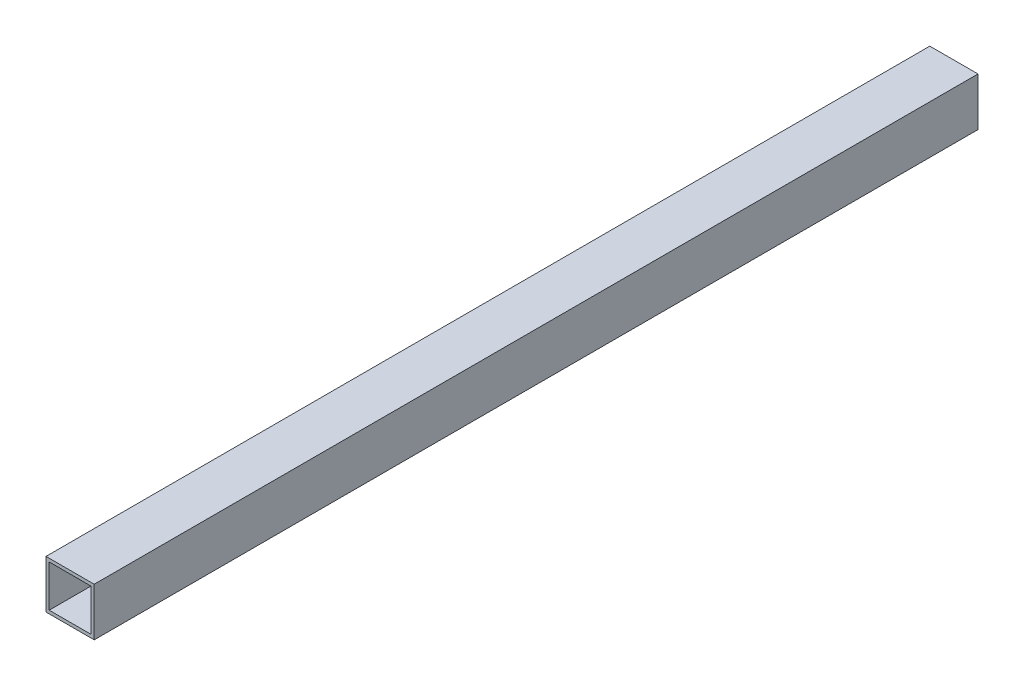
ISO-10303-21;
HEADER;
FILE_DESCRIPTION(('STEP AP214'),'2;1');
FILE_NAME('part.step','',(''),(''),'','','');
FILE_SCHEMA(('AUTOMOTIVE_DESIGN { 1 0 10303 214 1 1 1 1 }'));
ENDSEC;
DATA;
#1=APPLICATION_CONTEXT('core data for automotive mechanical design processes');
#2=APPLICATION_PROTOCOL_DEFINITION('international standard','automotive_design',2000,#1);
#3=PRODUCT_CONTEXT('',#1,'mechanical');
#4=PRODUCT('Part','Part','',(#3));
#5=PRODUCT_RELATED_PRODUCT_CATEGORY('part','',(#4));
#6=PRODUCT_DEFINITION_FORMATION('','',#4);
#7=PRODUCT_DEFINITION_CONTEXT('part definition',#1,'design');
#8=PRODUCT_DEFINITION('design','',#6,#7);
#9=PRODUCT_DEFINITION_SHAPE('','',#8);
#10=(LENGTH_UNIT() NAMED_UNIT(*) SI_UNIT(.MILLI.,.METRE.));
#11=(NAMED_UNIT(*) PLANE_ANGLE_UNIT() SI_UNIT($,.RADIAN.));
#12=(NAMED_UNIT(*) SI_UNIT($,.STERADIAN.) SOLID_ANGLE_UNIT());
#13=UNCERTAINTY_MEASURE_WITH_UNIT(LENGTH_MEASURE(1.E-05),#10,'distance_accuracy_value','');
#14=(GEOMETRIC_REPRESENTATION_CONTEXT(3) GLOBAL_UNCERTAINTY_ASSIGNED_CONTEXT((#13)) GLOBAL_UNIT_ASSIGNED_CONTEXT((#10,
#11,#12)) REPRESENTATION_CONTEXT('',''));
#15=CARTESIAN_POINT('',(0.,0.,0.));
#16=DIRECTION('',(0.,0.,1.));
#17=DIRECTION('',(1.,0.,0.));
#18=AXIS2_PLACEMENT_3D('',#15,#16,#17);
#19=CARTESIAN_POINT('',(-94.2052139280012,59.6622468790826,550.));
#20=DIRECTION('',(1.,0.,0.));
#21=DIRECTION('',(0.,0.,-1.));
#22=AXIS2_PLACEMENT_3D('',#19,#20,#21);
#23=PLANE('',#22);
#24=DIRECTION('',(0.,-1.,0.));
#25=VECTOR('',#24,1.);
#26=CARTESIAN_POINT('',(-94.2052139280012,59.6622468790826,0.));
#27=LINE('',#26,#25);
#28=CARTESIAN_POINT('',(-94.2052139280012,59.6622468790826,0.));
#29=VERTEX_POINT('',#28);
#30=CARTESIAN_POINT('',(-94.2052139280012,29.6622468790826,0.));
#31=VERTEX_POINT('',#30);
#32=EDGE_CURVE('E144',#29,#31,#27,.T.);
#33=ORIENTED_EDGE('',*,*,#32,.T.);
#34=DIRECTION('',(0.,0.,-1.));
#35=VECTOR('',#34,1.);
#36=CARTESIAN_POINT('',(-94.2052139280012,29.6622468790826,550.));
#37=LINE('',#36,#35);
#38=CARTESIAN_POINT('',(-94.2052139280012,29.6622468790826,550.));
#39=VERTEX_POINT('',#38);
#40=EDGE_CURVE('E11',#39,#31,#37,.T.);
#41=ORIENTED_EDGE('',*,*,#40,.F.);
#42=DIRECTION('',(0.,-1.,0.));
#43=VECTOR('',#42,1.);
#44=CARTESIAN_POINT('',(-94.2052139280012,59.6622468790826,550.));
#45=LINE('',#44,#43);
#46=CARTESIAN_POINT('',(-94.2052139280012,59.6622468790826,550.));
#47=VERTEX_POINT('',#46);
#48=EDGE_CURVE('E133',#47,#39,#45,.T.);
#49=ORIENTED_EDGE('',*,*,#48,.F.);
#50=DIRECTION('',(0.,0.,-1.));
#51=VECTOR('',#50,1.);
#52=CARTESIAN_POINT('',(-94.2052139280012,59.6622468790826,550.));
#53=LINE('',#52,#51);
#54=EDGE_CURVE('E143',#47,#29,#53,.T.);
#55=ORIENTED_EDGE('',*,*,#54,.T.);
#56=EDGE_LOOP('',(#33,#41,#49,#55));
#57=FACE_BOUND('',#56,.T.);
#58=ADVANCED_FACE('F36',(#57),#23,.F.);
#59=CARTESIAN_POINT('',(-94.2052139280012,29.6622468790826,550.));
#60=DIRECTION('',(0.,1.,0.));
#61=DIRECTION('',(0.,0.,1.));
#62=AXIS2_PLACEMENT_3D('',#59,#60,#61);
#63=PLANE('',#62);
#64=DIRECTION('',(1.,0.,0.));
#65=VECTOR('',#64,1.);
#66=CARTESIAN_POINT('',(-94.2052139280012,29.6622468790826,0.));
#67=LINE('',#66,#65);
#68=CARTESIAN_POINT('',(-64.2052139280012,29.6622468790826,0.));
#69=VERTEX_POINT('',#68);
#70=EDGE_CURVE('E147',#31,#69,#67,.T.);
#71=ORIENTED_EDGE('',*,*,#70,.T.);
#72=DIRECTION('',(0.,0.,-1.));
#73=VECTOR('',#72,1.);
#74=CARTESIAN_POINT('',(-64.2052139280012,29.6622468790826,550.));
#75=LINE('',#74,#73);
#76=CARTESIAN_POINT('',(-64.2052139280012,29.6622468790826,550.));
#77=VERTEX_POINT('',#76);
#78=EDGE_CURVE('E43',#77,#69,#75,.T.);
#79=ORIENTED_EDGE('',*,*,#78,.F.);
#80=DIRECTION('',(1.,0.,0.));
#81=VECTOR('',#80,1.);
#82=CARTESIAN_POINT('',(-94.2052139280012,29.6622468790826,550.));
#83=LINE('',#82,#81);
#84=EDGE_CURVE('E136',#39,#77,#83,.T.);
#85=ORIENTED_EDGE('',*,*,#84,.F.);
#86=ORIENTED_EDGE('',*,*,#40,.T.);
#87=EDGE_LOOP('',(#71,#79,#85,#86));
#88=FACE_BOUND('',#87,.T.);
#89=ADVANCED_FACE('F175',(#88),#63,.F.);
#90=CARTESIAN_POINT('',(-64.2052139280012,59.6622468790826,550.));
#91=DIRECTION('',(-1.,0.,0.));
#92=DIRECTION('',(0.,0.,1.));
#93=AXIS2_PLACEMENT_3D('',#90,#91,#92);
#94=PLANE('',#93);
#95=DIRECTION('',(0.,1.,0.));
#96=VECTOR('',#95,1.);
#97=CARTESIAN_POINT('',(-64.2052139280012,59.6622468790826,0.));
#98=LINE('',#97,#96);
#99=CARTESIAN_POINT('',(-64.2052139280012,59.6622468790826,0.));
#100=VERTEX_POINT('',#99);
#101=EDGE_CURVE('E149',#69,#100,#98,.T.);
#102=ORIENTED_EDGE('',*,*,#101,.T.);
#103=DIRECTION('',(0.,0.,-1.));
#104=VECTOR('',#103,1.);
#105=CARTESIAN_POINT('',(-64.2052139280012,59.6622468790826,550.));
#106=LINE('',#105,#104);
#107=CARTESIAN_POINT('',(-64.2052139280012,59.6622468790826,550.));
#108=VERTEX_POINT('',#107);
#109=EDGE_CURVE('E154',#108,#100,#106,.T.);
#110=ORIENTED_EDGE('',*,*,#109,.F.);
#111=DIRECTION('',(0.,1.,0.));
#112=VECTOR('',#111,1.);
#113=CARTESIAN_POINT('',(-64.2052139280012,59.6622468790826,550.));
#114=LINE('',#113,#112);
#115=EDGE_CURVE('E139',#77,#108,#114,.T.);
#116=ORIENTED_EDGE('',*,*,#115,.F.);
#117=ORIENTED_EDGE('',*,*,#78,.T.);
#118=EDGE_LOOP('',(#102,#110,#116,#117));
#119=FACE_BOUND('',#118,.T.);
#120=ADVANCED_FACE('F161',(#119),#94,.F.);
#121=CARTESIAN_POINT('',(-94.2052139280012,59.6622468790826,550.));
#122=DIRECTION('',(0.,-1.,0.));
#123=DIRECTION('',(0.,0.,-1.));
#124=AXIS2_PLACEMENT_3D('',#121,#122,#123);
#125=PLANE('',#124);
#126=DIRECTION('',(-1.,0.,0.));
#127=VECTOR('',#126,1.);
#128=CARTESIAN_POINT('',(-94.2052139280012,59.6622468790826,0.));
#129=LINE('',#128,#127);
#130=EDGE_CURVE('E137',#100,#29,#129,.T.);
#131=ORIENTED_EDGE('',*,*,#130,.T.);
#132=ORIENTED_EDGE('',*,*,#54,.F.);
#133=DIRECTION('',(-1.,0.,0.));
#134=VECTOR('',#133,1.);
#135=CARTESIAN_POINT('',(-94.2052139280012,59.6622468790826,550.));
#136=LINE('',#135,#134);
#137=EDGE_CURVE('E141',#108,#47,#136,.T.);
#138=ORIENTED_EDGE('',*,*,#137,.F.);
#139=ORIENTED_EDGE('',*,*,#109,.T.);
#140=EDGE_LOOP('',(#131,#132,#138,#139));
#141=FACE_BOUND('',#140,.T.);
#142=ADVANCED_FACE('F168',(#141),#125,.F.);
#143=CARTESIAN_POINT('',(0.,0.,550.));
#144=DIRECTION('',(0.,0.,1.));
#145=DIRECTION('',(1.,0.,0.));
#146=AXIS2_PLACEMENT_3D('',#143,#144,#145);
#147=PLANE('',#146);
#148=DIRECTION('',(0.,-1.,0.));
#149=VECTOR('',#148,1.);
#150=CARTESIAN_POINT('',(-92.2052139280012,59.6622468790826,550.));
#151=LINE('',#150,#149);
#152=CARTESIAN_POINT('',(-92.2052139280012,57.6622468790826,550.));
#153=VERTEX_POINT('',#152);
#154=CARTESIAN_POINT('',(-92.2052139280012,31.6622468790826,550.));
#155=VERTEX_POINT('',#154);
#156=EDGE_CURVE('E121',#153,#155,#151,.T.);
#157=ORIENTED_EDGE('',*,*,#156,.F.);
#158=DIRECTION('',(-1.,0.,0.));
#159=VECTOR('',#158,1.);
#160=CARTESIAN_POINT('',(-94.2052139280012,57.6622468790826,550.));
#161=LINE('',#160,#159);
#162=CARTESIAN_POINT('',(-66.2052139280012,57.6622468790826,550.));
#163=VERTEX_POINT('',#162);
#164=EDGE_CURVE('E105',#163,#153,#161,.T.);
#165=ORIENTED_EDGE('',*,*,#164,.F.);
#166=DIRECTION('',(0.,1.,0.));
#167=VECTOR('',#166,1.);
#168=CARTESIAN_POINT('',(-66.2052139280012,59.6622468790826,550.));
#169=LINE('',#168,#167);
#170=CARTESIAN_POINT('',(-66.2052139280012,31.6622468790826,550.));
#171=VERTEX_POINT('',#170);
#172=EDGE_CURVE('E130',#171,#163,#169,.T.);
#173=ORIENTED_EDGE('',*,*,#172,.F.);
#174=DIRECTION('',(1.,0.,0.));
#175=VECTOR('',#174,1.);
#176=CARTESIAN_POINT('',(-94.2052139280012,31.6622468790826,550.));
#177=LINE('',#176,#175);
#178=EDGE_CURVE('E123',#155,#171,#177,.T.);
#179=ORIENTED_EDGE('',*,*,#178,.F.);
#180=EDGE_LOOP('',(#157,#165,#173,#179));
#181=FACE_BOUND('',#180,.T.);
#182=ORIENTED_EDGE('',*,*,#48,.T.);
#183=ORIENTED_EDGE('',*,*,#84,.T.);
#184=ORIENTED_EDGE('',*,*,#115,.T.);
#185=ORIENTED_EDGE('',*,*,#137,.T.);
#186=EDGE_LOOP('',(#182,#183,#184,#185));
#187=FACE_BOUND('',#186,.T.);
#188=ADVANCED_FACE('F174',(#181,#187),#147,.T.);
#189=CARTESIAN_POINT('',(0.,0.,0.));
#190=DIRECTION('',(0.,0.,1.));
#191=DIRECTION('',(1.,0.,0.));
#192=AXIS2_PLACEMENT_3D('',#189,#190,#191);
#193=PLANE('',#192);
#194=DIRECTION('',(-1.,0.,0.));
#195=VECTOR('',#194,1.);
#196=CARTESIAN_POINT('',(-94.2052139280012,57.6622468790826,0.));
#197=LINE('',#196,#195);
#198=CARTESIAN_POINT('',(-66.2052139280012,57.6622468790826,0.));
#199=VERTEX_POINT('',#198);
#200=CARTESIAN_POINT('',(-92.2052139280012,57.6622468790826,0.));
#201=VERTEX_POINT('',#200);
#202=EDGE_CURVE('E103',#199,#201,#197,.T.);
#203=ORIENTED_EDGE('',*,*,#202,.T.);
#204=DIRECTION('',(0.,-1.,0.));
#205=VECTOR('',#204,1.);
#206=CARTESIAN_POINT('',(-92.2052139280012,59.6622468790826,0.));
#207=LINE('',#206,#205);
#208=CARTESIAN_POINT('',(-92.2052139280012,31.6622468790826,0.));
#209=VERTEX_POINT('',#208);
#210=EDGE_CURVE('E111',#201,#209,#207,.T.);
#211=ORIENTED_EDGE('',*,*,#210,.T.);
#212=DIRECTION('',(1.,0.,0.));
#213=VECTOR('',#212,1.);
#214=CARTESIAN_POINT('',(-94.2052139280012,31.6622468790826,0.));
#215=LINE('',#214,#213);
#216=CARTESIAN_POINT('',(-66.2052139280012,31.6622468790826,0.));
#217=VERTEX_POINT('',#216);
#218=EDGE_CURVE('E117',#209,#217,#215,.T.);
#219=ORIENTED_EDGE('',*,*,#218,.T.);
#220=DIRECTION('',(0.,1.,0.));
#221=VECTOR('',#220,1.);
#222=CARTESIAN_POINT('',(-66.2052139280012,59.6622468790826,0.));
#223=LINE('',#222,#221);
#224=EDGE_CURVE('E57',#217,#199,#223,.T.);
#225=ORIENTED_EDGE('',*,*,#224,.T.);
#226=EDGE_LOOP('',(#203,#211,#219,#225));
#227=FACE_BOUND('',#226,.T.);
#228=ORIENTED_EDGE('',*,*,#32,.F.);
#229=ORIENTED_EDGE('',*,*,#130,.F.);
#230=ORIENTED_EDGE('',*,*,#101,.F.);
#231=ORIENTED_EDGE('',*,*,#70,.F.);
#232=EDGE_LOOP('',(#228,#229,#230,#231));
#233=FACE_BOUND('',#232,.T.);
#234=ADVANCED_FACE('F119',(#227,#233),#193,.F.);
#235=CARTESIAN_POINT('',(-92.2052139280012,59.6622468790826,550.));
#236=DIRECTION('',(1.,0.,0.));
#237=DIRECTION('',(0.,0.,-1.));
#238=AXIS2_PLACEMENT_3D('',#235,#236,#237);
#239=PLANE('',#238);
#240=ORIENTED_EDGE('',*,*,#210,.F.);
#241=DIRECTION('',(0.,0.,-1.));
#242=VECTOR('',#241,1.);
#243=CARTESIAN_POINT('',(-92.2052139280012,57.6622468790826,550.));
#244=LINE('',#243,#242);
#245=EDGE_CURVE('E99',#153,#201,#244,.T.);
#246=ORIENTED_EDGE('',*,*,#245,.F.);
#247=ORIENTED_EDGE('',*,*,#156,.T.);
#248=DIRECTION('',(0.,0.,-1.));
#249=VECTOR('',#248,1.);
#250=CARTESIAN_POINT('',(-92.2052139280012,31.6622468790826,550.));
#251=LINE('',#250,#249);
#252=EDGE_CURVE('E114',#155,#209,#251,.T.);
#253=ORIENTED_EDGE('',*,*,#252,.T.);
#254=EDGE_LOOP('',(#240,#246,#247,#253));
#255=FACE_BOUND('',#254,.T.);
#256=ADVANCED_FACE('F112',(#255),#239,.T.);
#257=CARTESIAN_POINT('',(-94.2052139280012,31.6622468790826,550.));
#258=DIRECTION('',(0.,1.,0.));
#259=DIRECTION('',(0.,0.,1.));
#260=AXIS2_PLACEMENT_3D('',#257,#258,#259);
#261=PLANE('',#260);
#262=ORIENTED_EDGE('',*,*,#218,.F.);
#263=ORIENTED_EDGE('',*,*,#252,.F.);
#264=ORIENTED_EDGE('',*,*,#178,.T.);
#265=DIRECTION('',(0.,0.,-1.));
#266=VECTOR('',#265,1.);
#267=CARTESIAN_POINT('',(-66.2052139280012,31.6622468790826,550.));
#268=LINE('',#267,#266);
#269=EDGE_CURVE('E259',#171,#217,#268,.T.);
#270=ORIENTED_EDGE('',*,*,#269,.T.);
#271=EDGE_LOOP('',(#262,#263,#264,#270));
#272=FACE_BOUND('',#271,.T.);
#273=ADVANCED_FACE('F195',(#272),#261,.T.);
#274=CARTESIAN_POINT('',(-66.2052139280012,59.6622468790826,550.));
#275=DIRECTION('',(-1.,0.,0.));
#276=DIRECTION('',(0.,0.,1.));
#277=AXIS2_PLACEMENT_3D('',#274,#275,#276);
#278=PLANE('',#277);
#279=ORIENTED_EDGE('',*,*,#224,.F.);
#280=ORIENTED_EDGE('',*,*,#269,.F.);
#281=ORIENTED_EDGE('',*,*,#172,.T.);
#282=DIRECTION('',(0.,0.,-1.));
#283=VECTOR('',#282,1.);
#284=CARTESIAN_POINT('',(-66.2052139280012,57.6622468790826,550.));
#285=LINE('',#284,#283);
#286=EDGE_CURVE('E50',#163,#199,#285,.T.);
#287=ORIENTED_EDGE('',*,*,#286,.T.);
#288=EDGE_LOOP('',(#279,#280,#281,#287));
#289=FACE_BOUND('',#288,.T.);
#290=ADVANCED_FACE('F192',(#289),#278,.T.);
#291=CARTESIAN_POINT('',(-94.2052139280012,57.6622468790826,550.));
#292=DIRECTION('',(0.,-1.,0.));
#293=DIRECTION('',(0.,0.,-1.));
#294=AXIS2_PLACEMENT_3D('',#291,#292,#293);
#295=PLANE('',#294);
#296=ORIENTED_EDGE('',*,*,#202,.F.);
#297=ORIENTED_EDGE('',*,*,#286,.F.);
#298=ORIENTED_EDGE('',*,*,#164,.T.);
#299=ORIENTED_EDGE('',*,*,#245,.T.);
#300=EDGE_LOOP('',(#296,#297,#298,#299));
#301=FACE_BOUND('',#300,.T.);
#302=ADVANCED_FACE('F101',(#301),#295,.T.);
#303=CLOSED_SHELL('',(#58,#89,#120,#142,#188,#234,#256,#273,#290,#302));
#304=MANIFOLD_SOLID_BREP('B2',#303);
#305=ADVANCED_BREP_SHAPE_REPRESENTATION('',(#18,#304),#14);
#306=SHAPE_DEFINITION_REPRESENTATION(#9,#305);
ENDSEC;
END-ISO-10303-21;
